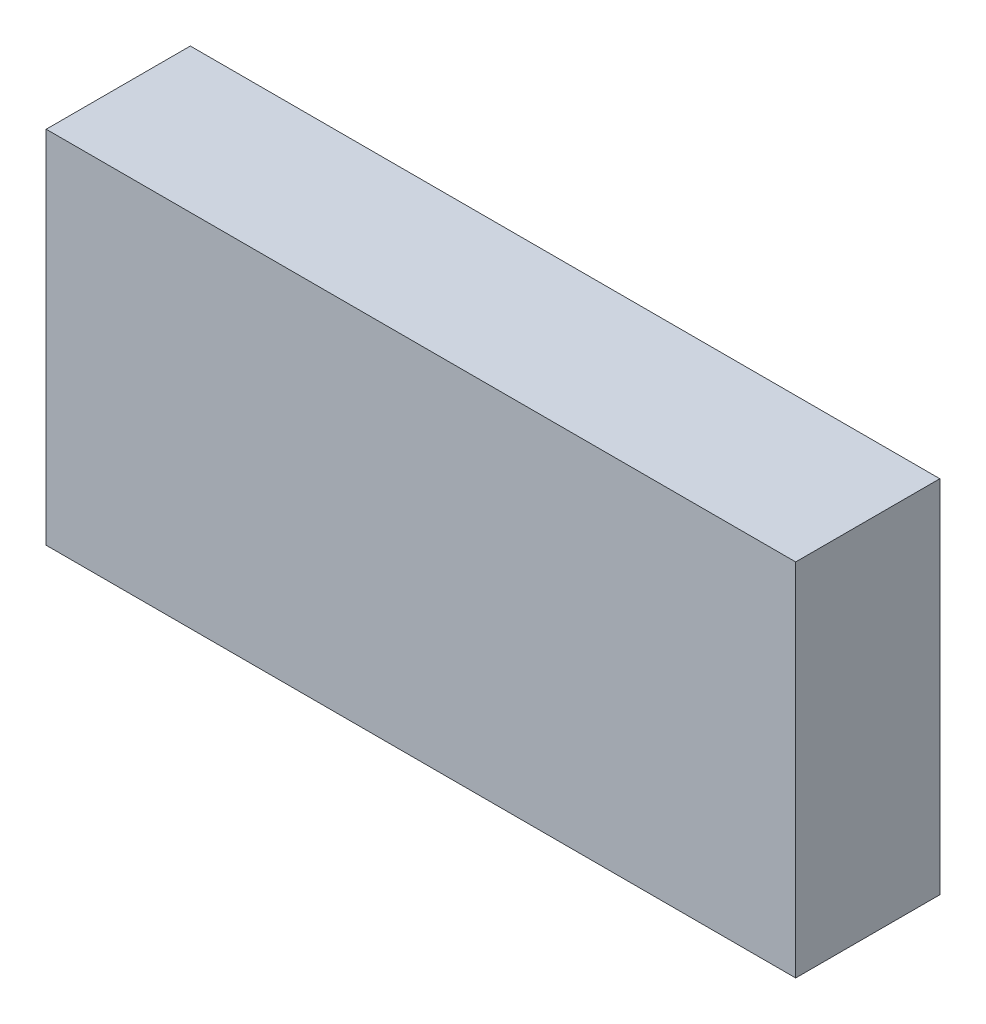
ISO-10303-21;
HEADER;
FILE_DESCRIPTION(('STEP AP214'),'2;1');
FILE_NAME('part.step','',(''),(''),'','','');
FILE_SCHEMA(('AUTOMOTIVE_DESIGN { 1 0 10303 214 1 1 1 1 }'));
ENDSEC;
DATA;
#1=APPLICATION_CONTEXT('core data for automotive mechanical design processes');
#2=APPLICATION_PROTOCOL_DEFINITION('international standard','automotive_design',2000,#1);
#3=PRODUCT_CONTEXT('',#1,'mechanical');
#4=PRODUCT('Part','Part','',(#3));
#5=PRODUCT_RELATED_PRODUCT_CATEGORY('part','',(#4));
#6=PRODUCT_DEFINITION_FORMATION('','',#4);
#7=PRODUCT_DEFINITION_CONTEXT('part definition',#1,'design');
#8=PRODUCT_DEFINITION('design','',#6,#7);
#9=PRODUCT_DEFINITION_SHAPE('','',#8);
#10=(LENGTH_UNIT() NAMED_UNIT(*) SI_UNIT(.MILLI.,.METRE.));
#11=(NAMED_UNIT(*) PLANE_ANGLE_UNIT() SI_UNIT($,.RADIAN.));
#12=(NAMED_UNIT(*) SI_UNIT($,.STERADIAN.) SOLID_ANGLE_UNIT());
#13=UNCERTAINTY_MEASURE_WITH_UNIT(LENGTH_MEASURE(1.E-05),#10,'distance_accuracy_value','');
#14=(GEOMETRIC_REPRESENTATION_CONTEXT(3) GLOBAL_UNCERTAINTY_ASSIGNED_CONTEXT((#13)) GLOBAL_UNIT_ASSIGNED_CONTEXT((#10,
#11,#12)) REPRESENTATION_CONTEXT('',''));
#15=CARTESIAN_POINT('',(0.,0.,0.));
#16=DIRECTION('',(0.,0.,1.));
#17=DIRECTION('',(1.,0.,0.));
#18=AXIS2_PLACEMENT_3D('',#15,#16,#17);
#19=CARTESIAN_POINT('',(1.29999994,-0.62500002,0.499999));
#20=DIRECTION('',(0.,0.,-1.));
#21=DIRECTION('',(-1.,0.,0.));
#22=AXIS2_PLACEMENT_3D('',#19,#20,#21);
#23=PLANE('',#22);
#24=DIRECTION('',(1.,0.,0.));
#25=VECTOR('',#24,1.);
#26=CARTESIAN_POINT('',(1.29999994,0.62500002,0.499999));
#27=LINE('',#26,#25);
#28=CARTESIAN_POINT('',(1.29999994,0.62500002,0.499999));
#29=VERTEX_POINT('',#28);
#30=CARTESIAN_POINT('',(-1.29999994,0.62500002,0.499999));
#31=VERTEX_POINT('',#30);
#32=EDGE_CURVE('E55',#29,#31,#27,.F.);
#33=ORIENTED_EDGE('',*,*,#32,.T.);
#34=DIRECTION('',(0.,1.,0.));
#35=VECTOR('',#34,1.);
#36=CARTESIAN_POINT('',(-1.29999994,0.62500002,0.499999));
#37=LINE('',#36,#35);
#38=CARTESIAN_POINT('',(-1.29999994,-0.62500002,0.499999));
#39=VERTEX_POINT('',#38);
#40=EDGE_CURVE('E58',#31,#39,#37,.F.);
#41=ORIENTED_EDGE('',*,*,#40,.T.);
#42=DIRECTION('',(1.,0.,0.));
#43=VECTOR('',#42,1.);
#44=CARTESIAN_POINT('',(-1.29999994,-0.62500002,0.499999));
#45=LINE('',#44,#43);
#46=CARTESIAN_POINT('',(1.29999994,-0.62500002,0.499999));
#47=VERTEX_POINT('',#46);
#48=EDGE_CURVE('E60',#39,#47,#45,.T.);
#49=ORIENTED_EDGE('',*,*,#48,.T.);
#50=DIRECTION('',(0.,1.,0.));
#51=VECTOR('',#50,1.);
#52=CARTESIAN_POINT('',(1.29999994,-0.62500002,0.499999));
#53=LINE('',#52,#51);
#54=EDGE_CURVE('E20',#29,#47,#53,.F.);
#55=ORIENTED_EDGE('',*,*,#54,.F.);
#56=EDGE_LOOP('',(#33,#41,#49,#55));
#57=FACE_BOUND('',#56,.T.);
#58=ADVANCED_FACE('F17',(#57),#23,.F.);
#59=CARTESIAN_POINT('',(-1.29999994,-0.62500002,0.));
#60=DIRECTION('',(0.,1.,0.));
#61=DIRECTION('',(0.,0.,1.));
#62=AXIS2_PLACEMENT_3D('',#59,#60,#61);
#63=PLANE('',#62);
#64=DIRECTION('',(0.,0.,1.));
#65=VECTOR('',#64,1.);
#66=CARTESIAN_POINT('',(1.29999994,-0.62500002,0.));
#67=LINE('',#66,#65);
#68=CARTESIAN_POINT('',(1.29999994,-0.62500002,0.));
#69=VERTEX_POINT('',#68);
#70=EDGE_CURVE('E71',#69,#47,#67,.T.);
#71=ORIENTED_EDGE('',*,*,#70,.T.);
#72=ORIENTED_EDGE('',*,*,#48,.F.);
#73=DIRECTION('',(0.,0.,-1.));
#74=VECTOR('',#73,1.);
#75=CARTESIAN_POINT('',(-1.29999994,-0.62500002,0.));
#76=LINE('',#75,#74);
#77=CARTESIAN_POINT('',(-1.29999994,-0.62500002,0.));
#78=VERTEX_POINT('',#77);
#79=EDGE_CURVE('E65',#39,#78,#76,.T.);
#80=ORIENTED_EDGE('',*,*,#79,.T.);
#81=DIRECTION('',(-1.,0.,0.));
#82=VECTOR('',#81,1.);
#83=CARTESIAN_POINT('',(1.29999994,-0.62500002,0.));
#84=LINE('',#83,#82);
#85=EDGE_CURVE('E83',#69,#78,#84,.T.);
#86=ORIENTED_EDGE('',*,*,#85,.F.);
#87=EDGE_LOOP('',(#71,#72,#80,#86));
#88=FACE_BOUND('',#87,.T.);
#89=ADVANCED_FACE('F68',(#88),#63,.F.);
#90=CARTESIAN_POINT('',(-1.29999994,0.62500002,0.));
#91=DIRECTION('',(1.,0.,0.));
#92=DIRECTION('',(0.,0.,-1.));
#93=AXIS2_PLACEMENT_3D('',#90,#91,#92);
#94=PLANE('',#93);
#95=ORIENTED_EDGE('',*,*,#79,.F.);
#96=ORIENTED_EDGE('',*,*,#40,.F.);
#97=DIRECTION('',(0.,0.,-1.));
#98=VECTOR('',#97,1.);
#99=CARTESIAN_POINT('',(-1.29999994,0.62500002,0.));
#100=LINE('',#99,#98);
#101=CARTESIAN_POINT('',(-1.29999994,0.62500002,0.));
#102=VERTEX_POINT('',#101);
#103=EDGE_CURVE('E77',#31,#102,#100,.T.);
#104=ORIENTED_EDGE('',*,*,#103,.T.);
#105=DIRECTION('',(0.,1.,0.));
#106=VECTOR('',#105,1.);
#107=CARTESIAN_POINT('',(-1.29999994,-0.62500002,0.));
#108=LINE('',#107,#106);
#109=EDGE_CURVE('E74',#78,#102,#108,.T.);
#110=ORIENTED_EDGE('',*,*,#109,.F.);
#111=EDGE_LOOP('',(#95,#96,#104,#110));
#112=FACE_BOUND('',#111,.T.);
#113=ADVANCED_FACE('F72',(#112),#94,.F.);
#114=CARTESIAN_POINT('',(1.29999994,0.62500002,0.));
#115=DIRECTION('',(0.,-1.,0.));
#116=DIRECTION('',(0.,0.,-1.));
#117=AXIS2_PLACEMENT_3D('',#114,#115,#116);
#118=PLANE('',#117);
#119=ORIENTED_EDGE('',*,*,#103,.F.);
#120=ORIENTED_EDGE('',*,*,#32,.F.);
#121=DIRECTION('',(0.,0.,1.));
#122=VECTOR('',#121,1.);
#123=CARTESIAN_POINT('',(1.29999994,0.62500002,0.));
#124=LINE('',#123,#122);
#125=CARTESIAN_POINT('',(1.29999994,0.62500002,0.));
#126=VERTEX_POINT('',#125);
#127=EDGE_CURVE('E35',#29,#126,#124,.F.);
#128=ORIENTED_EDGE('',*,*,#127,.T.);
#129=DIRECTION('',(-1.,0.,0.));
#130=VECTOR('',#129,1.);
#131=CARTESIAN_POINT('',(1.29999994,0.62500002,0.));
#132=LINE('',#131,#130);
#133=EDGE_CURVE('E26',#102,#126,#132,.F.);
#134=ORIENTED_EDGE('',*,*,#133,.F.);
#135=EDGE_LOOP('',(#119,#120,#128,#134));
#136=FACE_BOUND('',#135,.T.);
#137=ADVANCED_FACE('F89',(#136),#118,.F.);
#138=CARTESIAN_POINT('',(1.29999994,-0.62500002,0.));
#139=DIRECTION('',(-1.,0.,0.));
#140=DIRECTION('',(0.,0.,1.));
#141=AXIS2_PLACEMENT_3D('',#138,#139,#140);
#142=PLANE('',#141);
#143=ORIENTED_EDGE('',*,*,#127,.F.);
#144=ORIENTED_EDGE('',*,*,#54,.T.);
#145=ORIENTED_EDGE('',*,*,#70,.F.);
#146=DIRECTION('',(0.,1.,0.));
#147=VECTOR('',#146,1.);
#148=CARTESIAN_POINT('',(1.29999994,-0.62500002,0.));
#149=LINE('',#148,#147);
#150=EDGE_CURVE('E11',#126,#69,#149,.F.);
#151=ORIENTED_EDGE('',*,*,#150,.F.);
#152=EDGE_LOOP('',(#143,#144,#145,#151));
#153=FACE_BOUND('',#152,.T.);
#154=ADVANCED_FACE('F91',(#153),#142,.F.);
#155=CARTESIAN_POINT('',(1.29999994,-0.62500002,0.));
#156=DIRECTION('',(0.,0.,-1.));
#157=DIRECTION('',(-1.,0.,0.));
#158=AXIS2_PLACEMENT_3D('',#155,#156,#157);
#159=PLANE('',#158);
#160=ORIENTED_EDGE('',*,*,#133,.T.);
#161=ORIENTED_EDGE('',*,*,#150,.T.);
#162=ORIENTED_EDGE('',*,*,#85,.T.);
#163=ORIENTED_EDGE('',*,*,#109,.T.);
#164=EDGE_LOOP('',(#160,#161,#162,#163));
#165=FACE_BOUND('',#164,.T.);
#166=ADVANCED_FACE('F88',(#165),#159,.T.);
#167=CLOSED_SHELL('',(#58,#89,#113,#137,#154,#166));
#168=MANIFOLD_SOLID_BREP('B1',#167);
#169=ADVANCED_BREP_SHAPE_REPRESENTATION('',(#18,#168),#14);
#170=SHAPE_DEFINITION_REPRESENTATION(#9,#169);
ENDSEC;
END-ISO-10303-21;
